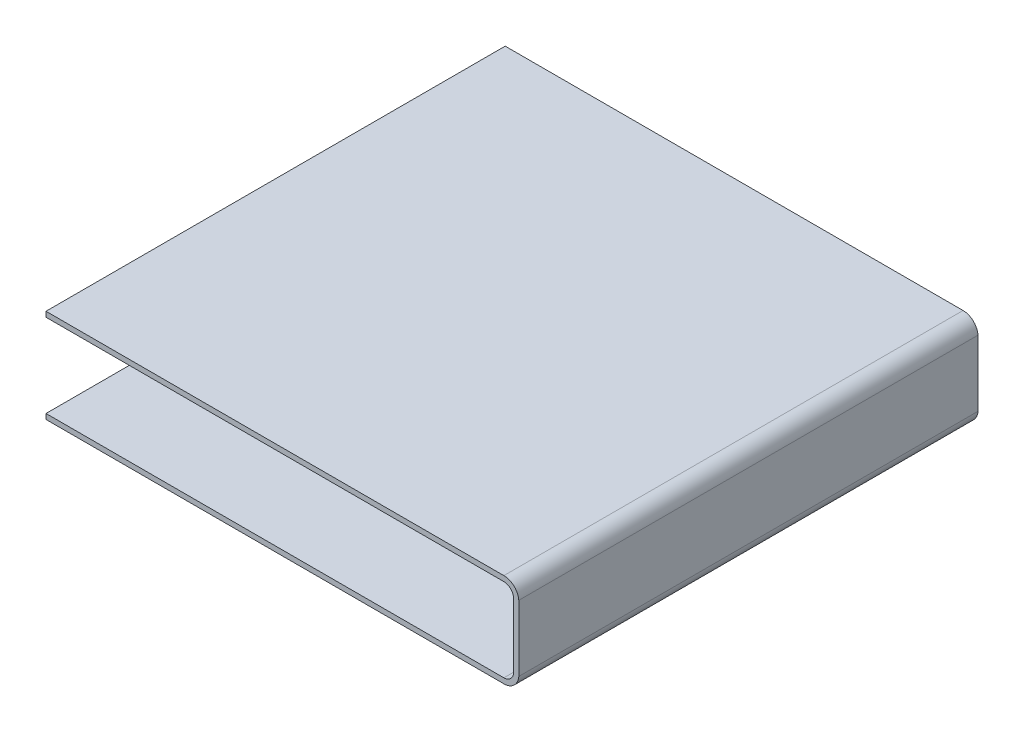
ISO-10303-21;
HEADER;
FILE_DESCRIPTION(('STEP AP214'),'2;1');
FILE_NAME('part.step','',(''),(''),'','','');
FILE_SCHEMA(('AUTOMOTIVE_DESIGN { 1 0 10303 214 1 1 1 1 }'));
ENDSEC;
DATA;
#1=APPLICATION_CONTEXT('core data for automotive mechanical design processes');
#2=APPLICATION_PROTOCOL_DEFINITION('international standard','automotive_design',2000,#1);
#3=PRODUCT_CONTEXT('',#1,'mechanical');
#4=PRODUCT('Part','Part','',(#3));
#5=PRODUCT_RELATED_PRODUCT_CATEGORY('part','',(#4));
#6=PRODUCT_DEFINITION_FORMATION('','',#4);
#7=PRODUCT_DEFINITION_CONTEXT('part definition',#1,'design');
#8=PRODUCT_DEFINITION('design','',#6,#7);
#9=PRODUCT_DEFINITION_SHAPE('','',#8);
#10=(LENGTH_UNIT() NAMED_UNIT(*) SI_UNIT(.MILLI.,.METRE.));
#11=(NAMED_UNIT(*) PLANE_ANGLE_UNIT() SI_UNIT($,.RADIAN.));
#12=(NAMED_UNIT(*) SI_UNIT($,.STERADIAN.) SOLID_ANGLE_UNIT());
#13=UNCERTAINTY_MEASURE_WITH_UNIT(LENGTH_MEASURE(1.E-05),#10,'distance_accuracy_value','');
#14=(GEOMETRIC_REPRESENTATION_CONTEXT(3) GLOBAL_UNCERTAINTY_ASSIGNED_CONTEXT((#13)) GLOBAL_UNIT_ASSIGNED_CONTEXT((#10,
#11,#12)) REPRESENTATION_CONTEXT('',''));
#15=CARTESIAN_POINT('',(0.,0.,0.));
#16=DIRECTION('',(0.,0.,1.));
#17=DIRECTION('',(1.,0.,0.));
#18=AXIS2_PLACEMENT_3D('',#15,#16,#17);
#19=CARTESIAN_POINT('',(-1262.29562957931,110.,9680.));
#20=DIRECTION('',(0.,-1.,0.));
#21=DIRECTION('',(0.,0.,-1.));
#22=AXIS2_PLACEMENT_3D('',#19,#20,#21);
#23=PLANE('',#22);
#24=DIRECTION('',(1.,0.,0.));
#25=VECTOR('',#24,1.);
#26=CARTESIAN_POINT('',(-1262.29562957931,110.,0.));
#27=LINE('',#26,#25);
#28=CARTESIAN_POINT('',(8389.70437042069,110.,0.));
#29=VERTEX_POINT('',#28);
#30=CARTESIAN_POINT('',(-1262.29562957931,110.,0.));
#31=VERTEX_POINT('',#30);
#32=EDGE_CURVE('E158',#29,#31,#27,.F.);
#33=ORIENTED_EDGE('',*,*,#32,.T.);
#34=DIRECTION('',(0.,0.,-1.));
#35=VECTOR('',#34,1.);
#36=CARTESIAN_POINT('',(-1262.29562957931,110.,9680.));
#37=LINE('',#36,#35);
#38=CARTESIAN_POINT('',(-1262.29562957931,110.,9680.));
#39=VERTEX_POINT('',#38);
#40=EDGE_CURVE('E11',#39,#31,#37,.T.);
#41=ORIENTED_EDGE('',*,*,#40,.F.);
#42=DIRECTION('',(1.,0.,0.));
#43=VECTOR('',#42,1.);
#44=CARTESIAN_POINT('',(-1262.29562957931,110.,9680.));
#45=LINE('',#44,#43);
#46=CARTESIAN_POINT('',(8389.70437042069,110.,9680.));
#47=VERTEX_POINT('',#46);
#48=EDGE_CURVE('E106',#47,#39,#45,.F.);
#49=ORIENTED_EDGE('',*,*,#48,.F.);
#50=DIRECTION('',(0.,0.,-1.));
#51=VECTOR('',#50,1.);
#52=CARTESIAN_POINT('',(8389.70437042069,110.,9680.));
#53=LINE('',#52,#51);
#54=EDGE_CURVE('E154',#47,#29,#53,.T.);
#55=ORIENTED_EDGE('',*,*,#54,.T.);
#56=EDGE_LOOP('',(#33,#41,#49,#55));
#57=FACE_BOUND('',#56,.T.);
#58=ADVANCED_FACE('F38',(#57),#23,.F.);
#59=CARTESIAN_POINT('',(-1262.29562957931,0.,9680.));
#60=DIRECTION('',(-1.,0.,0.));
#61=DIRECTION('',(0.,0.,1.));
#62=AXIS2_PLACEMENT_3D('',#59,#60,#61);
#63=PLANE('',#62);
#64=DIRECTION('',(0.,1.,0.));
#65=VECTOR('',#64,1.);
#66=CARTESIAN_POINT('',(-1262.29562957931,0.,0.));
#67=LINE('',#66,#65);
#68=CARTESIAN_POINT('',(-1262.29562957931,0.,0.));
#69=VERTEX_POINT('',#68);
#70=EDGE_CURVE('E161',#69,#31,#67,.T.);
#71=ORIENTED_EDGE('',*,*,#70,.F.);
#72=DIRECTION('',(0.,0.,-1.));
#73=VECTOR('',#72,1.);
#74=CARTESIAN_POINT('',(-1262.29562957931,0.,9680.));
#75=LINE('',#74,#73);
#76=CARTESIAN_POINT('',(-1262.29562957931,0.,9680.));
#77=VERTEX_POINT('',#76);
#78=EDGE_CURVE('E46',#77,#69,#75,.T.);
#79=ORIENTED_EDGE('',*,*,#78,.F.);
#80=DIRECTION('',(0.,1.,0.));
#81=VECTOR('',#80,1.);
#82=CARTESIAN_POINT('',(-1262.29562957931,0.,9680.));
#83=LINE('',#82,#81);
#84=EDGE_CURVE('E223',#77,#39,#83,.T.);
#85=ORIENTED_EDGE('',*,*,#84,.T.);
#86=ORIENTED_EDGE('',*,*,#40,.T.);
#87=EDGE_LOOP('',(#71,#79,#85,#86));
#88=FACE_BOUND('',#87,.T.);
#89=ADVANCED_FACE('F210',(#88),#63,.T.);
#90=CARTESIAN_POINT('',(-1262.29562957931,0.,9680.));
#91=DIRECTION('',(0.,-1.,0.));
#92=DIRECTION('',(0.,0.,-1.));
#93=AXIS2_PLACEMENT_3D('',#90,#91,#92);
#94=PLANE('',#93);
#95=DIRECTION('',(-1.,0.,0.));
#96=VECTOR('',#95,1.);
#97=CARTESIAN_POINT('',(-1262.29562957931,0.,0.));
#98=LINE('',#97,#96);
#99=CARTESIAN_POINT('',(8389.70437042069,2.77555756156289E-13,0.));
#100=VERTEX_POINT('',#99);
#101=EDGE_CURVE('E164',#100,#69,#98,.T.);
#102=ORIENTED_EDGE('',*,*,#101,.F.);
#103=DIRECTION('',(0.,0.,-1.));
#104=VECTOR('',#103,1.);
#105=CARTESIAN_POINT('',(8389.70437042069,2.77555756156289E-13,9680.));
#106=LINE('',#105,#104);
#107=CARTESIAN_POINT('',(8389.70437042069,2.77555756156289E-13,9680.));
#108=VERTEX_POINT('',#107);
#109=EDGE_CURVE('E200',#108,#100,#106,.T.);
#110=ORIENTED_EDGE('',*,*,#109,.F.);
#111=DIRECTION('',(-1.,0.,0.));
#112=VECTOR('',#111,1.);
#113=CARTESIAN_POINT('',(-1262.29562957931,0.,9680.));
#114=LINE('',#113,#112);
#115=EDGE_CURVE('E207',#108,#77,#114,.T.);
#116=ORIENTED_EDGE('',*,*,#115,.T.);
#117=ORIENTED_EDGE('',*,*,#78,.T.);
#118=EDGE_LOOP('',(#102,#110,#116,#117));
#119=FACE_BOUND('',#118,.T.);
#120=ADVANCED_FACE('F205',(#119),#94,.T.);
#121=CARTESIAN_POINT('',(8389.70437042069,315.598663005312,9680.));
#122=DIRECTION('',(0.,0.,-1.));
#123=DIRECTION('',(-1.,0.,0.));
#124=AXIS2_PLACEMENT_3D('',#121,#122,#123);
#125=CYLINDRICAL_SURFACE('',#124,315.598663005312);
#126=CARTESIAN_POINT('',(8389.70437042069,315.598663005312,0.));
#127=DIRECTION('',(0.,0.,-1.));
#128=DIRECTION('',(1.,0.,0.));
#129=AXIS2_PLACEMENT_3D('',#126,#127,#128);
#130=CIRCLE('',#129,315.598663005312);
#131=CARTESIAN_POINT('',(8704.50700095543,293.197326010618,0.));
#132=VERTEX_POINT('',#131);
#133=EDGE_CURVE('E167',#132,#100,#130,.T.);
#134=ORIENTED_EDGE('',*,*,#133,.F.);
#135=DIRECTION('',(0.,0.,-1.));
#136=VECTOR('',#135,1.);
#137=CARTESIAN_POINT('',(8704.50700095543,293.197326010618,9680.));
#138=LINE('',#137,#136);
#139=CARTESIAN_POINT('',(8704.50700095543,293.197326010618,9680.));
#140=VERTEX_POINT('',#139);
#141=EDGE_CURVE('E198',#140,#132,#138,.T.);
#142=ORIENTED_EDGE('',*,*,#141,.F.);
#143=CARTESIAN_POINT('',(8389.70437042069,315.598663005312,9680.));
#144=DIRECTION('',(0.,0.,-1.));
#145=DIRECTION('',(1.,0.,0.));
#146=AXIS2_PLACEMENT_3D('',#143,#144,#145);
#147=CIRCLE('',#146,315.598663005312);
#148=EDGE_CURVE('E220',#140,#108,#147,.T.);
#149=ORIENTED_EDGE('',*,*,#148,.T.);
#150=ORIENTED_EDGE('',*,*,#109,.T.);
#151=EDGE_LOOP('',(#134,#142,#149,#150));
#152=FACE_BOUND('',#151,.T.);
#153=ADVANCED_FACE('F217',(#152),#125,.T.);
#154=CARTESIAN_POINT('',(8704.50700095543,1682.80267398938,9680.));
#155=DIRECTION('',(1.,0.,0.));
#156=DIRECTION('',(0.,0.,-1.));
#157=AXIS2_PLACEMENT_3D('',#154,#155,#156);
#158=PLANE('',#157);
#159=DIRECTION('',(0.,-1.,0.));
#160=VECTOR('',#159,1.);
#161=CARTESIAN_POINT('',(8704.50700095543,1682.80267398938,0.));
#162=LINE('',#161,#160);
#163=CARTESIAN_POINT('',(8704.50700095543,1682.80267398938,0.));
#164=VERTEX_POINT('',#163);
#165=EDGE_CURVE('E170',#164,#132,#162,.T.);
#166=ORIENTED_EDGE('',*,*,#165,.F.);
#167=DIRECTION('',(0.,0.,-1.));
#168=VECTOR('',#167,1.);
#169=CARTESIAN_POINT('',(8704.50700095543,1682.80267398938,9680.));
#170=LINE('',#169,#168);
#171=CARTESIAN_POINT('',(8704.50700095543,1682.80267398938,9680.));
#172=VERTEX_POINT('',#171);
#173=EDGE_CURVE('E196',#172,#164,#170,.T.);
#174=ORIENTED_EDGE('',*,*,#173,.F.);
#175=DIRECTION('',(0.,-1.,0.));
#176=VECTOR('',#175,1.);
#177=CARTESIAN_POINT('',(8704.50700095543,1682.80267398938,9680.));
#178=LINE('',#177,#176);
#179=EDGE_CURVE('E225',#172,#140,#178,.T.);
#180=ORIENTED_EDGE('',*,*,#179,.T.);
#181=ORIENTED_EDGE('',*,*,#141,.T.);
#182=EDGE_LOOP('',(#166,#174,#180,#181));
#183=FACE_BOUND('',#182,.T.);
#184=ADVANCED_FACE('F328',(#183),#158,.T.);
#185=CARTESIAN_POINT('',(8389.70437042069,1660.40133699469,9680.));
#186=DIRECTION('',(0.,0.,-1.));
#187=DIRECTION('',(-1.,0.,0.));
#188=AXIS2_PLACEMENT_3D('',#185,#186,#187);
#189=CYLINDRICAL_SURFACE('',#188,315.598663005312);
#190=CARTESIAN_POINT('',(8389.70437042069,1660.40133699469,0.));
#191=DIRECTION('',(0.,0.,-1.));
#192=DIRECTION('',(-1.,0.,0.));
#193=AXIS2_PLACEMENT_3D('',#190,#191,#192);
#194=CIRCLE('',#193,315.598663005312);
#195=CARTESIAN_POINT('',(8389.70437042069,1976.,0.));
#196=VERTEX_POINT('',#195);
#197=EDGE_CURVE('E173',#196,#164,#194,.T.);
#198=ORIENTED_EDGE('',*,*,#197,.F.);
#199=DIRECTION('',(0.,0.,-1.));
#200=VECTOR('',#199,1.);
#201=CARTESIAN_POINT('',(8389.70437042069,1976.,9680.));
#202=LINE('',#201,#200);
#203=CARTESIAN_POINT('',(8389.70437042069,1976.,9680.));
#204=VERTEX_POINT('',#203);
#205=EDGE_CURVE('E194',#204,#196,#202,.T.);
#206=ORIENTED_EDGE('',*,*,#205,.F.);
#207=CARTESIAN_POINT('',(8389.70437042069,1660.40133699469,9680.));
#208=DIRECTION('',(0.,0.,-1.));
#209=DIRECTION('',(-1.,0.,0.));
#210=AXIS2_PLACEMENT_3D('',#207,#208,#209);
#211=CIRCLE('',#210,315.598663005312);
#212=EDGE_CURVE('E231',#204,#172,#211,.T.);
#213=ORIENTED_EDGE('',*,*,#212,.T.);
#214=ORIENTED_EDGE('',*,*,#173,.T.);
#215=EDGE_LOOP('',(#198,#206,#213,#214));
#216=FACE_BOUND('',#215,.T.);
#217=ADVANCED_FACE('F319',(#216),#189,.T.);
#218=CARTESIAN_POINT('',(-1262.29562957931,1976.,9680.));
#219=DIRECTION('',(0.,1.,0.));
#220=DIRECTION('',(0.,0.,1.));
#221=AXIS2_PLACEMENT_3D('',#218,#219,#220);
#222=PLANE('',#221);
#223=DIRECTION('',(1.,0.,0.));
#224=VECTOR('',#223,1.);
#225=CARTESIAN_POINT('',(-1262.29562957931,1976.,0.));
#226=LINE('',#225,#224);
#227=CARTESIAN_POINT('',(-1262.29562957931,1976.,0.));
#228=VERTEX_POINT('',#227);
#229=EDGE_CURVE('E176',#228,#196,#226,.T.);
#230=ORIENTED_EDGE('',*,*,#229,.F.);
#231=DIRECTION('',(0.,0.,-1.));
#232=VECTOR('',#231,1.);
#233=CARTESIAN_POINT('',(-1262.29562957931,1976.,9680.));
#234=LINE('',#233,#232);
#235=CARTESIAN_POINT('',(-1262.29562957931,1976.,9680.));
#236=VERTEX_POINT('',#235);
#237=EDGE_CURVE('E192',#236,#228,#234,.T.);
#238=ORIENTED_EDGE('',*,*,#237,.F.);
#239=DIRECTION('',(1.,0.,0.));
#240=VECTOR('',#239,1.);
#241=CARTESIAN_POINT('',(-1262.29562957931,1976.,9680.));
#242=LINE('',#241,#240);
#243=EDGE_CURVE('E234',#236,#204,#242,.T.);
#244=ORIENTED_EDGE('',*,*,#243,.T.);
#245=ORIENTED_EDGE('',*,*,#205,.T.);
#246=EDGE_LOOP('',(#230,#238,#244,#245));
#247=FACE_BOUND('',#246,.T.);
#248=ADVANCED_FACE('F246',(#247),#222,.T.);
#249=CARTESIAN_POINT('',(-1262.29562957931,1866.,9680.));
#250=DIRECTION('',(-1.,0.,0.));
#251=DIRECTION('',(0.,0.,1.));
#252=AXIS2_PLACEMENT_3D('',#249,#250,#251);
#253=PLANE('',#252);
#254=DIRECTION('',(0.,1.,0.));
#255=VECTOR('',#254,1.);
#256=CARTESIAN_POINT('',(-1262.29562957931,1866.,0.));
#257=LINE('',#256,#255);
#258=CARTESIAN_POINT('',(-1262.29562957931,1866.,0.));
#259=VERTEX_POINT('',#258);
#260=EDGE_CURVE('E179',#259,#228,#257,.T.);
#261=ORIENTED_EDGE('',*,*,#260,.F.);
#262=DIRECTION('',(0.,0.,-1.));
#263=VECTOR('',#262,1.);
#264=CARTESIAN_POINT('',(-1262.29562957931,1866.,9680.));
#265=LINE('',#264,#263);
#266=CARTESIAN_POINT('',(-1262.29562957931,1866.,9680.));
#267=VERTEX_POINT('',#266);
#268=EDGE_CURVE('E190',#267,#259,#265,.T.);
#269=ORIENTED_EDGE('',*,*,#268,.F.);
#270=DIRECTION('',(0.,1.,0.));
#271=VECTOR('',#270,1.);
#272=CARTESIAN_POINT('',(-1262.29562957931,1866.,9680.));
#273=LINE('',#272,#271);
#274=EDGE_CURVE('E237',#267,#236,#273,.T.);
#275=ORIENTED_EDGE('',*,*,#274,.T.);
#276=ORIENTED_EDGE('',*,*,#237,.T.);
#277=EDGE_LOOP('',(#261,#269,#275,#276));
#278=FACE_BOUND('',#277,.T.);
#279=ADVANCED_FACE('F241',(#278),#253,.T.);
#280=CARTESIAN_POINT('',(-1262.29562957931,1866.,9680.));
#281=DIRECTION('',(0.,1.,0.));
#282=DIRECTION('',(0.,0.,1.));
#283=AXIS2_PLACEMENT_3D('',#280,#281,#282);
#284=PLANE('',#283);
#285=DIRECTION('',(1.,0.,0.));
#286=VECTOR('',#285,1.);
#287=CARTESIAN_POINT('',(-1262.29562957931,1866.,0.));
#288=LINE('',#287,#286);
#289=CARTESIAN_POINT('',(8389.70437042069,1866.,0.));
#290=VERTEX_POINT('',#289);
#291=EDGE_CURVE('E182',#259,#290,#288,.T.);
#292=ORIENTED_EDGE('',*,*,#291,.T.);
#293=DIRECTION('',(0.,0.,-1.));
#294=VECTOR('',#293,1.);
#295=CARTESIAN_POINT('',(8389.70437042069,1866.,9680.));
#296=LINE('',#295,#294);
#297=CARTESIAN_POINT('',(8389.70437042069,1866.,9680.));
#298=VERTEX_POINT('',#297);
#299=EDGE_CURVE('E149',#298,#290,#296,.T.);
#300=ORIENTED_EDGE('',*,*,#299,.F.);
#301=DIRECTION('',(1.,0.,0.));
#302=VECTOR('',#301,1.);
#303=CARTESIAN_POINT('',(-1262.29562957931,1866.,9680.));
#304=LINE('',#303,#302);
#305=EDGE_CURVE('E140',#267,#298,#304,.T.);
#306=ORIENTED_EDGE('',*,*,#305,.F.);
#307=ORIENTED_EDGE('',*,*,#268,.T.);
#308=EDGE_LOOP('',(#292,#300,#306,#307));
#309=FACE_BOUND('',#308,.T.);
#310=ADVANCED_FACE('F250',(#309),#284,.F.);
#311=CARTESIAN_POINT('',(8389.70437042069,1660.40133699469,9680.));
#312=DIRECTION('',(0.,0.,-1.));
#313=DIRECTION('',(-1.,0.,0.));
#314=AXIS2_PLACEMENT_3D('',#311,#312,#313);
#315=CYLINDRICAL_SURFACE('',#314,205.598663005312);
#316=CARTESIAN_POINT('',(8389.70437042069,1660.40133699469,0.));
#317=DIRECTION('',(0.,0.,1.));
#318=DIRECTION('',(1.,0.,0.));
#319=AXIS2_PLACEMENT_3D('',#316,#317,#318);
#320=CIRCLE('',#319,205.598663005312);
#321=CARTESIAN_POINT('',(8594.50700095543,1678.47598099183,0.));
#322=VERTEX_POINT('',#321);
#323=EDGE_CURVE('E148',#290,#322,#320,.F.);
#324=ORIENTED_EDGE('',*,*,#323,.T.);
#325=DIRECTION('',(0.,0.,-1.));
#326=VECTOR('',#325,1.);
#327=CARTESIAN_POINT('',(8594.50700095543,1678.47598099183,9680.));
#328=LINE('',#327,#326);
#329=CARTESIAN_POINT('',(8594.50700095543,1678.47598099183,9680.));
#330=VERTEX_POINT('',#329);
#331=EDGE_CURVE('E145',#330,#322,#328,.T.);
#332=ORIENTED_EDGE('',*,*,#331,.F.);
#333=CARTESIAN_POINT('',(8389.70437042069,1660.40133699469,9680.));
#334=DIRECTION('',(0.,0.,1.));
#335=DIRECTION('',(1.,0.,0.));
#336=AXIS2_PLACEMENT_3D('',#333,#334,#335);
#337=CIRCLE('',#336,205.598663005312);
#338=EDGE_CURVE('E133',#298,#330,#337,.F.);
#339=ORIENTED_EDGE('',*,*,#338,.F.);
#340=ORIENTED_EDGE('',*,*,#299,.T.);
#341=EDGE_LOOP('',(#324,#332,#339,#340));
#342=FACE_BOUND('',#341,.T.);
#343=ADVANCED_FACE('F146',(#342),#315,.F.);
#344=CARTESIAN_POINT('',(8594.50700095543,1682.80267398938,9680.));
#345=DIRECTION('',(1.,0.,0.));
#346=DIRECTION('',(0.,0.,-1.));
#347=AXIS2_PLACEMENT_3D('',#344,#345,#346);
#348=PLANE('',#347);
#349=DIRECTION('',(0.,1.,0.));
#350=VECTOR('',#349,1.);
#351=CARTESIAN_POINT('',(8594.50700095543,1682.80267398938,0.));
#352=LINE('',#351,#350);
#353=CARTESIAN_POINT('',(8594.50700095543,297.524019008171,0.));
#354=VERTEX_POINT('',#353);
#355=EDGE_CURVE('E94',#322,#354,#352,.F.);
#356=ORIENTED_EDGE('',*,*,#355,.T.);
#357=DIRECTION('',(0.,0.,-1.));
#358=VECTOR('',#357,1.);
#359=CARTESIAN_POINT('',(8594.50700095543,297.524019008171,9680.));
#360=LINE('',#359,#358);
#361=CARTESIAN_POINT('',(8594.50700095543,297.524019008171,9680.));
#362=VERTEX_POINT('',#361);
#363=EDGE_CURVE('E150',#362,#354,#360,.T.);
#364=ORIENTED_EDGE('',*,*,#363,.F.);
#365=DIRECTION('',(0.,1.,0.));
#366=VECTOR('',#365,1.);
#367=CARTESIAN_POINT('',(8594.50700095543,1682.80267398938,9680.));
#368=LINE('',#367,#366);
#369=EDGE_CURVE('E137',#330,#362,#368,.F.);
#370=ORIENTED_EDGE('',*,*,#369,.F.);
#371=ORIENTED_EDGE('',*,*,#331,.T.);
#372=EDGE_LOOP('',(#356,#364,#370,#371));
#373=FACE_BOUND('',#372,.T.);
#374=ADVANCED_FACE('F152',(#373),#348,.F.);
#375=CARTESIAN_POINT('',(8389.70437042069,315.598663005312,9680.));
#376=DIRECTION('',(0.,0.,-1.));
#377=DIRECTION('',(-1.,0.,0.));
#378=AXIS2_PLACEMENT_3D('',#375,#376,#377);
#379=CYLINDRICAL_SURFACE('',#378,205.598663005312);
#380=CARTESIAN_POINT('',(8389.70437042069,315.598663005312,0.));
#381=DIRECTION('',(0.,0.,1.));
#382=DIRECTION('',(1.,0.,0.));
#383=AXIS2_PLACEMENT_3D('',#380,#381,#382);
#384=CIRCLE('',#383,205.598663005312);
#385=EDGE_CURVE('E100',#354,#29,#384,.F.);
#386=ORIENTED_EDGE('',*,*,#385,.T.);
#387=ORIENTED_EDGE('',*,*,#54,.F.);
#388=CARTESIAN_POINT('',(8389.70437042069,315.598663005312,9680.));
#389=DIRECTION('',(0.,0.,1.));
#390=DIRECTION('',(1.,0.,0.));
#391=AXIS2_PLACEMENT_3D('',#388,#389,#390);
#392=CIRCLE('',#391,205.598663005312);
#393=EDGE_CURVE('E54',#362,#47,#392,.F.);
#394=ORIENTED_EDGE('',*,*,#393,.F.);
#395=ORIENTED_EDGE('',*,*,#363,.T.);
#396=EDGE_LOOP('',(#386,#387,#394,#395));
#397=FACE_BOUND('',#396,.T.);
#398=ADVANCED_FACE('F264',(#397),#379,.F.);
#399=CARTESIAN_POINT('',(8389.70437042069,315.598663005312,9680.));
#400=DIRECTION('',(0.,0.,-1.));
#401=DIRECTION('',(-1.,0.,0.));
#402=AXIS2_PLACEMENT_3D('',#399,#400,#401);
#403=PLANE('',#402);
#404=ORIENTED_EDGE('',*,*,#48,.T.);
#405=ORIENTED_EDGE('',*,*,#84,.F.);
#406=ORIENTED_EDGE('',*,*,#115,.F.);
#407=ORIENTED_EDGE('',*,*,#148,.F.);
#408=ORIENTED_EDGE('',*,*,#179,.F.);
#409=ORIENTED_EDGE('',*,*,#212,.F.);
#410=ORIENTED_EDGE('',*,*,#243,.F.);
#411=ORIENTED_EDGE('',*,*,#274,.F.);
#412=ORIENTED_EDGE('',*,*,#305,.T.);
#413=ORIENTED_EDGE('',*,*,#338,.T.);
#414=ORIENTED_EDGE('',*,*,#369,.T.);
#415=ORIENTED_EDGE('',*,*,#393,.T.);
#416=EDGE_LOOP('',(#404,#405,#406,#407,#408,#409,#410,#411,#412,#413,#414,#415));
#417=FACE_BOUND('',#416,.T.);
#418=ADVANCED_FACE('F135',(#417),#403,.F.);
#419=CARTESIAN_POINT('',(8389.70437042069,315.598663005312,0.));
#420=DIRECTION('',(0.,0.,-1.));
#421=DIRECTION('',(-1.,0.,0.));
#422=AXIS2_PLACEMENT_3D('',#419,#420,#421);
#423=PLANE('',#422);
#424=ORIENTED_EDGE('',*,*,#32,.F.);
#425=ORIENTED_EDGE('',*,*,#385,.F.);
#426=ORIENTED_EDGE('',*,*,#355,.F.);
#427=ORIENTED_EDGE('',*,*,#323,.F.);
#428=ORIENTED_EDGE('',*,*,#291,.F.);
#429=ORIENTED_EDGE('',*,*,#260,.T.);
#430=ORIENTED_EDGE('',*,*,#229,.T.);
#431=ORIENTED_EDGE('',*,*,#197,.T.);
#432=ORIENTED_EDGE('',*,*,#165,.T.);
#433=ORIENTED_EDGE('',*,*,#133,.T.);
#434=ORIENTED_EDGE('',*,*,#101,.T.);
#435=ORIENTED_EDGE('',*,*,#70,.T.);
#436=EDGE_LOOP('',(#424,#425,#426,#427,#428,#429,#430,#431,#432,#433,#434,#435));
#437=FACE_BOUND('',#436,.T.);
#438=ADVANCED_FACE('F213',(#437),#423,.T.);
#439=CLOSED_SHELL('',(#58,#89,#120,#153,#184,#217,#248,#279,#310,#343,#374,#398,#418,#438));
#440=MANIFOLD_SOLID_BREP('B2',#439);
#441=ADVANCED_BREP_SHAPE_REPRESENTATION('',(#18,#440),#14);
#442=SHAPE_DEFINITION_REPRESENTATION(#9,#441);
ENDSEC;
END-ISO-10303-21;
